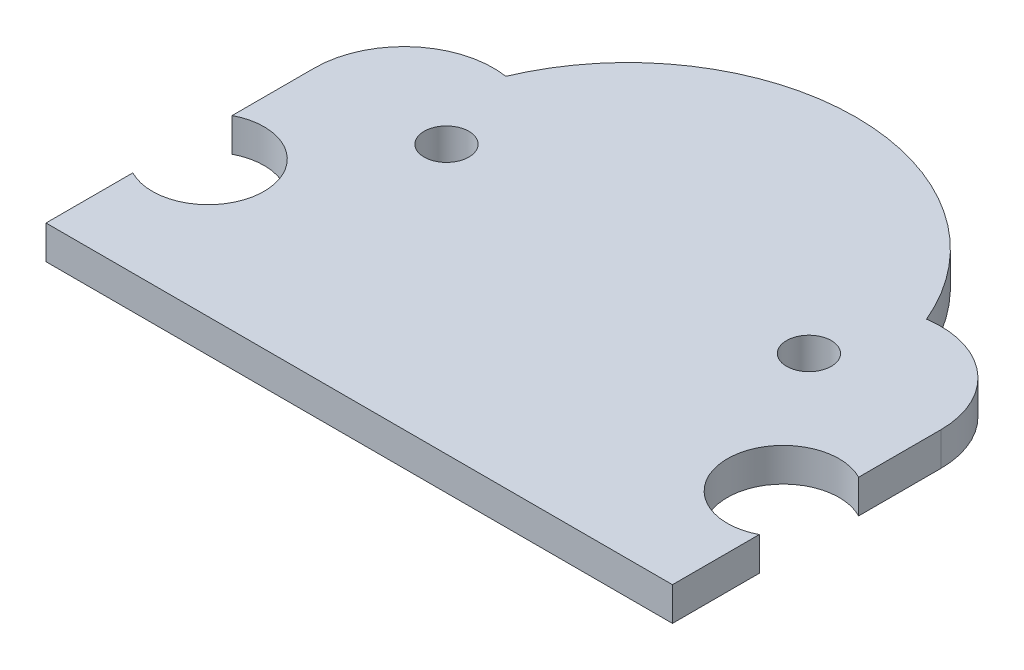
ISO-10303-21;
HEADER;
FILE_DESCRIPTION(('STEP AP214'),'2;1');
FILE_NAME('part.step','',(''),(''),'','','');
FILE_SCHEMA(('AUTOMOTIVE_DESIGN { 1 0 10303 214 1 1 1 1 }'));
ENDSEC;
DATA;
#1=APPLICATION_CONTEXT('core data for automotive mechanical design processes');
#2=APPLICATION_PROTOCOL_DEFINITION('international standard','automotive_design',2000,#1);
#3=PRODUCT_CONTEXT('',#1,'mechanical');
#4=PRODUCT('Part','Part','',(#3));
#5=PRODUCT_RELATED_PRODUCT_CATEGORY('part','',(#4));
#6=PRODUCT_DEFINITION_FORMATION('','',#4);
#7=PRODUCT_DEFINITION_CONTEXT('part definition',#1,'design');
#8=PRODUCT_DEFINITION('design','',#6,#7);
#9=PRODUCT_DEFINITION_SHAPE('','',#8);
#10=(LENGTH_UNIT() NAMED_UNIT(*) SI_UNIT(.MILLI.,.METRE.));
#11=(NAMED_UNIT(*) PLANE_ANGLE_UNIT() SI_UNIT($,.RADIAN.));
#12=(NAMED_UNIT(*) SI_UNIT($,.STERADIAN.) SOLID_ANGLE_UNIT());
#13=UNCERTAINTY_MEASURE_WITH_UNIT(LENGTH_MEASURE(1.E-05),#10,'distance_accuracy_value','');
#14=(GEOMETRIC_REPRESENTATION_CONTEXT(3) GLOBAL_UNCERTAINTY_ASSIGNED_CONTEXT((#13)) GLOBAL_UNIT_ASSIGNED_CONTEXT((#10,
#11,#12)) REPRESENTATION_CONTEXT('',''));
#15=CARTESIAN_POINT('',(0.,0.,0.));
#16=DIRECTION('',(0.,0.,1.));
#17=DIRECTION('',(1.,0.,0.));
#18=AXIS2_PLACEMENT_3D('',#15,#16,#17);
#19=CARTESIAN_POINT('',(26.85,1.5,-6.1));
#20=DIRECTION('',(0.,1.,0.));
#21=DIRECTION('',(0.,0.,1.));
#22=AXIS2_PLACEMENT_3D('',#19,#20,#21);
#23=PLANE('',#22);
#24=CARTESIAN_POINT('',(5.9,1.5,-12.));
#25=DIRECTION('',(0.,1.,0.));
#26=DIRECTION('',(0.,0.,1.));
#27=AXIS2_PLACEMENT_3D('',#24,#25,#26);
#28=CIRCLE('',#27,1.);
#29=CARTESIAN_POINT('',(5.9,1.5,-11.));
#30=VERTEX_POINT('',#29);
#31=EDGE_CURVE('E150',#30,#30,#28,.T.);
#32=ORIENTED_EDGE('',*,*,#31,.F.);
#33=EDGE_LOOP('',(#32));
#34=FACE_BOUND('',#33,.T.);
#35=DIRECTION('',(0.,0.,-1.));
#36=VECTOR('',#35,1.);
#37=CARTESIAN_POINT('',(28.,1.5,0.));
#38=LINE('',#37,#36);
#39=CARTESIAN_POINT('',(28.,1.5,0.));
#40=VERTEX_POINT('',#39);
#41=CARTESIAN_POINT('',(28.,1.5,-3.88020271195769));
#42=VERTEX_POINT('',#41);
#43=EDGE_CURVE('E165',#40,#42,#38,.T.);
#44=ORIENTED_EDGE('',*,*,#43,.T.);
#45=CARTESIAN_POINT('',(26.85,1.5,-6.1));
#46=DIRECTION('',(0.,-1.,0.));
#47=DIRECTION('',(0.,0.,1.));
#48=AXIS2_PLACEMENT_3D('',#45,#46,#47);
#49=CIRCLE('',#48,2.49999999999999);
#50=CARTESIAN_POINT('',(28.,1.5,-8.31979728804231));
#51=VERTEX_POINT('',#50);
#52=EDGE_CURVE('E103',#42,#51,#49,.T.);
#53=ORIENTED_EDGE('',*,*,#52,.T.);
#54=DIRECTION('',(0.,0.,-1.));
#55=VECTOR('',#54,1.);
#56=CARTESIAN_POINT('',(28.,1.5,-8.31979728804231));
#57=LINE('',#56,#55);
#58=CARTESIAN_POINT('',(28.,1.5,-12.));
#59=VERTEX_POINT('',#58);
#60=EDGE_CURVE('E186',#51,#59,#57,.T.);
#61=ORIENTED_EDGE('',*,*,#60,.T.);
#62=CARTESIAN_POINT('',(24.,1.5,-12.));
#63=DIRECTION('',(0.,1.,0.));
#64=DIRECTION('',(0.,0.,1.));
#65=AXIS2_PLACEMENT_3D('',#62,#63,#64);
#66=CIRCLE('',#65,4.00000000000001);
#67=CARTESIAN_POINT('',(23.4,1.5,-15.954743986657));
#68=VERTEX_POINT('',#67);
#69=EDGE_CURVE('E205',#59,#68,#66,.T.);
#70=ORIENTED_EDGE('',*,*,#69,.T.);
#71=CARTESIAN_POINT('',(14.,1.5,-12.));
#72=DIRECTION('',(0.,1.,0.));
#73=DIRECTION('',(0.,0.,1.));
#74=AXIS2_PLACEMENT_3D('',#71,#72,#73);
#75=CIRCLE('',#74,10.1980390271856);
#76=CARTESIAN_POINT('',(4.59999999999999,1.5,-15.954743986657));
#77=VERTEX_POINT('',#76);
#78=EDGE_CURVE('E202',#68,#77,#75,.T.);
#79=ORIENTED_EDGE('',*,*,#78,.T.);
#80=CARTESIAN_POINT('',(4.,1.5,-12.));
#81=DIRECTION('',(0.,1.,0.));
#82=DIRECTION('',(0.,0.,1.));
#83=AXIS2_PLACEMENT_3D('',#80,#81,#82);
#84=CIRCLE('',#83,4.);
#85=CARTESIAN_POINT('',(0.,1.5,-12.));
#86=VERTEX_POINT('',#85);
#87=EDGE_CURVE('E204',#77,#86,#84,.T.);
#88=ORIENTED_EDGE('',*,*,#87,.T.);
#89=DIRECTION('',(0.,0.,1.));
#90=VECTOR('',#89,1.);
#91=CARTESIAN_POINT('',(0.,1.5,-12.));
#92=LINE('',#91,#90);
#93=CARTESIAN_POINT('',(0.,1.5,-8.31979728804232));
#94=VERTEX_POINT('',#93);
#95=EDGE_CURVE('E128',#86,#94,#92,.T.);
#96=ORIENTED_EDGE('',*,*,#95,.T.);
#97=CARTESIAN_POINT('',(1.15,1.5,-6.1));
#98=DIRECTION('',(0.,-1.,0.));
#99=DIRECTION('',(0.,0.,1.));
#100=AXIS2_PLACEMENT_3D('',#97,#98,#99);
#101=CIRCLE('',#100,2.5);
#102=CARTESIAN_POINT('',(0.,1.5,-3.88020271195769));
#103=VERTEX_POINT('',#102);
#104=EDGE_CURVE('E122',#94,#103,#101,.T.);
#105=ORIENTED_EDGE('',*,*,#104,.T.);
#106=DIRECTION('',(0.,0.,1.));
#107=VECTOR('',#106,1.);
#108=CARTESIAN_POINT('',(0.,1.5,-3.88020271195769));
#109=LINE('',#108,#107);
#110=CARTESIAN_POINT('',(0.,1.5,0.));
#111=VERTEX_POINT('',#110);
#112=EDGE_CURVE('E126',#103,#111,#109,.T.);
#113=ORIENTED_EDGE('',*,*,#112,.T.);
#114=DIRECTION('',(1.,0.,0.));
#115=VECTOR('',#114,1.);
#116=CARTESIAN_POINT('',(0.,1.5,0.));
#117=LINE('',#116,#115);
#118=EDGE_CURVE('E54',#111,#40,#117,.T.);
#119=ORIENTED_EDGE('',*,*,#118,.T.);
#120=EDGE_LOOP('',(#44,#53,#61,#70,#79,#88,#96,#105,#113,#119));
#121=FACE_BOUND('',#120,.T.);
#122=CARTESIAN_POINT('',(22.1,1.5,-12.));
#123=DIRECTION('',(0.,1.,0.));
#124=DIRECTION('',(0.,0.,1.));
#125=AXIS2_PLACEMENT_3D('',#122,#123,#124);
#126=CIRCLE('',#125,1.);
#127=CARTESIAN_POINT('',(22.1,1.5,-11.));
#128=VERTEX_POINT('',#127);
#129=EDGE_CURVE('E216',#128,#128,#126,.T.);
#130=ORIENTED_EDGE('',*,*,#129,.F.);
#131=EDGE_LOOP('',(#130));
#132=FACE_BOUND('',#131,.T.);
#133=ADVANCED_FACE('F37',(#34,#121,#132),#23,.T.);
#134=CARTESIAN_POINT('',(26.85,0.,-6.1));
#135=DIRECTION('',(0.,1.,0.));
#136=DIRECTION('',(0.,0.,1.));
#137=AXIS2_PLACEMENT_3D('',#134,#135,#136);
#138=PLANE('',#137);
#139=DIRECTION('',(0.,0.,-1.));
#140=VECTOR('',#139,1.);
#141=CARTESIAN_POINT('',(28.,0.,0.));
#142=LINE('',#141,#140);
#143=CARTESIAN_POINT('',(28.,0.,0.));
#144=VERTEX_POINT('',#143);
#145=CARTESIAN_POINT('',(28.,0.,-3.88020271195769));
#146=VERTEX_POINT('',#145);
#147=EDGE_CURVE('E146',#144,#146,#142,.T.);
#148=ORIENTED_EDGE('',*,*,#147,.F.);
#149=DIRECTION('',(1.,0.,0.));
#150=VECTOR('',#149,1.);
#151=CARTESIAN_POINT('',(0.,0.,0.));
#152=LINE('',#151,#150);
#153=CARTESIAN_POINT('',(0.,0.,0.));
#154=VERTEX_POINT('',#153);
#155=EDGE_CURVE('E95',#154,#144,#152,.T.);
#156=ORIENTED_EDGE('',*,*,#155,.F.);
#157=DIRECTION('',(0.,0.,1.));
#158=VECTOR('',#157,1.);
#159=CARTESIAN_POINT('',(0.,0.,-3.88020271195769));
#160=LINE('',#159,#158);
#161=CARTESIAN_POINT('',(0.,0.,-3.88020271195769));
#162=VERTEX_POINT('',#161);
#163=EDGE_CURVE('E89',#162,#154,#160,.T.);
#164=ORIENTED_EDGE('',*,*,#163,.F.);
#165=CARTESIAN_POINT('',(1.15,0.,-6.1));
#166=DIRECTION('',(0.,-1.,0.));
#167=DIRECTION('',(0.,0.,1.));
#168=AXIS2_PLACEMENT_3D('',#165,#166,#167);
#169=CIRCLE('',#168,2.5);
#170=CARTESIAN_POINT('',(0.,0.,-8.31979728804232));
#171=VERTEX_POINT('',#170);
#172=EDGE_CURVE('E136',#171,#162,#169,.T.);
#173=ORIENTED_EDGE('',*,*,#172,.F.);
#174=DIRECTION('',(0.,0.,1.));
#175=VECTOR('',#174,1.);
#176=CARTESIAN_POINT('',(0.,0.,-12.));
#177=LINE('',#176,#175);
#178=CARTESIAN_POINT('',(0.,0.,-12.));
#179=VERTEX_POINT('',#178);
#180=EDGE_CURVE('E160',#179,#171,#177,.T.);
#181=ORIENTED_EDGE('',*,*,#180,.F.);
#182=CARTESIAN_POINT('',(4.,0.,-12.));
#183=DIRECTION('',(0.,1.,0.));
#184=DIRECTION('',(0.,0.,1.));
#185=AXIS2_PLACEMENT_3D('',#182,#183,#184);
#186=CIRCLE('',#185,4.);
#187=CARTESIAN_POINT('',(4.59999999999999,0.,-15.954743986657));
#188=VERTEX_POINT('',#187);
#189=EDGE_CURVE('E158',#188,#179,#186,.T.);
#190=ORIENTED_EDGE('',*,*,#189,.F.);
#191=CARTESIAN_POINT('',(14.,0.,-12.));
#192=DIRECTION('',(0.,1.,0.));
#193=DIRECTION('',(0.,0.,1.));
#194=AXIS2_PLACEMENT_3D('',#191,#192,#193);
#195=CIRCLE('',#194,10.1980390271856);
#196=CARTESIAN_POINT('',(23.4,0.,-15.954743986657));
#197=VERTEX_POINT('',#196);
#198=EDGE_CURVE('E156',#197,#188,#195,.T.);
#199=ORIENTED_EDGE('',*,*,#198,.F.);
#200=CARTESIAN_POINT('',(24.,0.,-12.));
#201=DIRECTION('',(0.,1.,0.));
#202=DIRECTION('',(0.,0.,1.));
#203=AXIS2_PLACEMENT_3D('',#200,#201,#202);
#204=CIRCLE('',#203,4.00000000000001);
#205=CARTESIAN_POINT('',(28.,0.,-12.));
#206=VERTEX_POINT('',#205);
#207=EDGE_CURVE('E154',#206,#197,#204,.T.);
#208=ORIENTED_EDGE('',*,*,#207,.F.);
#209=DIRECTION('',(0.,0.,-1.));
#210=VECTOR('',#209,1.);
#211=CARTESIAN_POINT('',(28.,0.,-8.31979728804231));
#212=LINE('',#211,#210);
#213=CARTESIAN_POINT('',(28.,0.,-8.31979728804231));
#214=VERTEX_POINT('',#213);
#215=EDGE_CURVE('E152',#214,#206,#212,.T.);
#216=ORIENTED_EDGE('',*,*,#215,.F.);
#217=CARTESIAN_POINT('',(26.85,0.,-6.1));
#218=DIRECTION('',(0.,-1.,0.));
#219=DIRECTION('',(0.,0.,1.));
#220=AXIS2_PLACEMENT_3D('',#217,#218,#219);
#221=CIRCLE('',#220,2.49999999999999);
#222=EDGE_CURVE('E149',#146,#214,#221,.T.);
#223=ORIENTED_EDGE('',*,*,#222,.F.);
#224=EDGE_LOOP('',(#148,#156,#164,#173,#181,#190,#199,#208,#216,#223));
#225=FACE_BOUND('',#224,.T.);
#226=CARTESIAN_POINT('',(5.9,0.,-12.));
#227=DIRECTION('',(0.,1.,0.));
#228=DIRECTION('',(0.,0.,1.));
#229=AXIS2_PLACEMENT_3D('',#226,#227,#228);
#230=CIRCLE('',#229,1.);
#231=CARTESIAN_POINT('',(5.9,0.,-11.));
#232=VERTEX_POINT('',#231);
#233=EDGE_CURVE('E213',#232,#232,#230,.T.);
#234=ORIENTED_EDGE('',*,*,#233,.T.);
#235=EDGE_LOOP('',(#234));
#236=FACE_BOUND('',#235,.T.);
#237=CARTESIAN_POINT('',(22.1,0.,-12.));
#238=DIRECTION('',(0.,1.,0.));
#239=DIRECTION('',(0.,0.,1.));
#240=AXIS2_PLACEMENT_3D('',#237,#238,#239);
#241=CIRCLE('',#240,1.);
#242=CARTESIAN_POINT('',(22.1,0.,-11.));
#243=VERTEX_POINT('',#242);
#244=EDGE_CURVE('E219',#243,#243,#241,.T.);
#245=ORIENTED_EDGE('',*,*,#244,.T.);
#246=EDGE_LOOP('',(#245));
#247=FACE_BOUND('',#246,.T.);
#248=ADVANCED_FACE('F190',(#225,#236,#247),#138,.F.);
#249=CARTESIAN_POINT('',(28.,1.5,0.));
#250=DIRECTION('',(-1.,0.,0.));
#251=DIRECTION('',(0.,0.,1.));
#252=AXIS2_PLACEMENT_3D('',#249,#250,#251);
#253=PLANE('',#252);
#254=ORIENTED_EDGE('',*,*,#147,.T.);
#255=DIRECTION('',(0.,-1.,0.));
#256=VECTOR('',#255,1.);
#257=CARTESIAN_POINT('',(28.,1.5,-3.88020271195769));
#258=LINE('',#257,#256);
#259=EDGE_CURVE('E11',#42,#146,#258,.T.);
#260=ORIENTED_EDGE('',*,*,#259,.F.);
#261=ORIENTED_EDGE('',*,*,#43,.F.);
#262=DIRECTION('',(0.,-1.,0.));
#263=VECTOR('',#262,1.);
#264=CARTESIAN_POINT('',(28.,1.5,0.));
#265=LINE('',#264,#263);
#266=EDGE_CURVE('E142',#40,#144,#265,.T.);
#267=ORIENTED_EDGE('',*,*,#266,.T.);
#268=EDGE_LOOP('',(#254,#260,#261,#267));
#269=FACE_BOUND('',#268,.T.);
#270=ADVANCED_FACE('F39',(#269),#253,.F.);
#271=CARTESIAN_POINT('',(26.85,1.5,-6.1));
#272=DIRECTION('',(0.,-1.,0.));
#273=DIRECTION('',(0.,0.,-1.));
#274=AXIS2_PLACEMENT_3D('',#271,#272,#273);
#275=CYLINDRICAL_SURFACE('',#274,2.49999999999999);
#276=ORIENTED_EDGE('',*,*,#222,.T.);
#277=DIRECTION('',(0.,-1.,0.));
#278=VECTOR('',#277,1.);
#279=CARTESIAN_POINT('',(28.,1.5,-8.31979728804231));
#280=LINE('',#279,#278);
#281=EDGE_CURVE('E46',#51,#214,#280,.T.);
#282=ORIENTED_EDGE('',*,*,#281,.F.);
#283=ORIENTED_EDGE('',*,*,#52,.F.);
#284=ORIENTED_EDGE('',*,*,#259,.T.);
#285=EDGE_LOOP('',(#276,#282,#283,#284));
#286=FACE_BOUND('',#285,.T.);
#287=ADVANCED_FACE('F259',(#286),#275,.F.);
#288=CARTESIAN_POINT('',(28.,1.5,-8.31979728804231));
#289=DIRECTION('',(-1.,0.,0.));
#290=DIRECTION('',(0.,0.,1.));
#291=AXIS2_PLACEMENT_3D('',#288,#289,#290);
#292=PLANE('',#291);
#293=ORIENTED_EDGE('',*,*,#215,.T.);
#294=DIRECTION('',(0.,-1.,0.));
#295=VECTOR('',#294,1.);
#296=CARTESIAN_POINT('',(28.,1.5,-12.));
#297=LINE('',#296,#295);
#298=EDGE_CURVE('E178',#59,#206,#297,.T.);
#299=ORIENTED_EDGE('',*,*,#298,.F.);
#300=ORIENTED_EDGE('',*,*,#60,.F.);
#301=ORIENTED_EDGE('',*,*,#281,.T.);
#302=EDGE_LOOP('',(#293,#299,#300,#301));
#303=FACE_BOUND('',#302,.T.);
#304=ADVANCED_FACE('F184',(#303),#292,.F.);
#305=CARTESIAN_POINT('',(24.,1.5,-12.));
#306=DIRECTION('',(0.,-1.,0.));
#307=DIRECTION('',(0.,0.,-1.));
#308=AXIS2_PLACEMENT_3D('',#305,#306,#307);
#309=CYLINDRICAL_SURFACE('',#308,4.00000000000001);
#310=ORIENTED_EDGE('',*,*,#207,.T.);
#311=DIRECTION('',(0.,-1.,0.));
#312=VECTOR('',#311,1.);
#313=CARTESIAN_POINT('',(23.4,1.5,-15.954743986657));
#314=LINE('',#313,#312);
#315=EDGE_CURVE('E175',#68,#197,#314,.T.);
#316=ORIENTED_EDGE('',*,*,#315,.F.);
#317=ORIENTED_EDGE('',*,*,#69,.F.);
#318=ORIENTED_EDGE('',*,*,#298,.T.);
#319=EDGE_LOOP('',(#310,#316,#317,#318));
#320=FACE_BOUND('',#319,.T.);
#321=ADVANCED_FACE('F196',(#320),#309,.T.);
#322=CARTESIAN_POINT('',(14.,1.5,-12.));
#323=DIRECTION('',(0.,-1.,0.));
#324=DIRECTION('',(0.,0.,-1.));
#325=AXIS2_PLACEMENT_3D('',#322,#323,#324);
#326=CYLINDRICAL_SURFACE('',#325,10.1980390271856);
#327=ORIENTED_EDGE('',*,*,#198,.T.);
#328=DIRECTION('',(0.,-1.,0.));
#329=VECTOR('',#328,1.);
#330=CARTESIAN_POINT('',(4.59999999999999,1.5,-15.954743986657));
#331=LINE('',#330,#329);
#332=EDGE_CURVE('E172',#77,#188,#331,.T.);
#333=ORIENTED_EDGE('',*,*,#332,.F.);
#334=ORIENTED_EDGE('',*,*,#78,.F.);
#335=ORIENTED_EDGE('',*,*,#315,.T.);
#336=EDGE_LOOP('',(#327,#333,#334,#335));
#337=FACE_BOUND('',#336,.T.);
#338=ADVANCED_FACE('F200',(#337),#326,.T.);
#339=CARTESIAN_POINT('',(4.,1.5,-12.));
#340=DIRECTION('',(0.,-1.,0.));
#341=DIRECTION('',(0.,0.,-1.));
#342=AXIS2_PLACEMENT_3D('',#339,#340,#341);
#343=CYLINDRICAL_SURFACE('',#342,4.);
#344=ORIENTED_EDGE('',*,*,#189,.T.);
#345=DIRECTION('',(0.,-1.,0.));
#346=VECTOR('',#345,1.);
#347=CARTESIAN_POINT('',(0.,1.5,-12.));
#348=LINE('',#347,#346);
#349=EDGE_CURVE('E169',#86,#179,#348,.T.);
#350=ORIENTED_EDGE('',*,*,#349,.F.);
#351=ORIENTED_EDGE('',*,*,#87,.F.);
#352=ORIENTED_EDGE('',*,*,#332,.T.);
#353=EDGE_LOOP('',(#344,#350,#351,#352));
#354=FACE_BOUND('',#353,.T.);
#355=ADVANCED_FACE('F249',(#354),#343,.T.);
#356=CARTESIAN_POINT('',(0.,1.5,-12.));
#357=DIRECTION('',(1.,0.,0.));
#358=DIRECTION('',(0.,0.,-1.));
#359=AXIS2_PLACEMENT_3D('',#356,#357,#358);
#360=PLANE('',#359);
#361=ORIENTED_EDGE('',*,*,#180,.T.);
#362=DIRECTION('',(0.,-1.,0.));
#363=VECTOR('',#362,1.);
#364=CARTESIAN_POINT('',(0.,1.5,-8.31979728804232));
#365=LINE('',#364,#363);
#366=EDGE_CURVE('E137',#94,#171,#365,.T.);
#367=ORIENTED_EDGE('',*,*,#366,.F.);
#368=ORIENTED_EDGE('',*,*,#95,.F.);
#369=ORIENTED_EDGE('',*,*,#349,.T.);
#370=EDGE_LOOP('',(#361,#367,#368,#369));
#371=FACE_BOUND('',#370,.T.);
#372=ADVANCED_FACE('F246',(#371),#360,.F.);
#373=CARTESIAN_POINT('',(1.15,1.5,-6.1));
#374=DIRECTION('',(0.,-1.,0.));
#375=DIRECTION('',(0.,0.,-1.));
#376=AXIS2_PLACEMENT_3D('',#373,#374,#375);
#377=CYLINDRICAL_SURFACE('',#376,2.5);
#378=ORIENTED_EDGE('',*,*,#172,.T.);
#379=DIRECTION('',(0.,-1.,0.));
#380=VECTOR('',#379,1.);
#381=CARTESIAN_POINT('',(0.,1.5,-3.88020271195769));
#382=LINE('',#381,#380);
#383=EDGE_CURVE('E133',#103,#162,#382,.T.);
#384=ORIENTED_EDGE('',*,*,#383,.F.);
#385=ORIENTED_EDGE('',*,*,#104,.F.);
#386=ORIENTED_EDGE('',*,*,#366,.T.);
#387=EDGE_LOOP('',(#378,#384,#385,#386));
#388=FACE_BOUND('',#387,.T.);
#389=ADVANCED_FACE('F134',(#388),#377,.F.);
#390=CARTESIAN_POINT('',(0.,1.5,-3.88020271195769));
#391=DIRECTION('',(1.,0.,0.));
#392=DIRECTION('',(0.,0.,-1.));
#393=AXIS2_PLACEMENT_3D('',#390,#391,#392);
#394=PLANE('',#393);
#395=ORIENTED_EDGE('',*,*,#163,.T.);
#396=DIRECTION('',(0.,-1.,0.));
#397=VECTOR('',#396,1.);
#398=CARTESIAN_POINT('',(0.,1.5,0.));
#399=LINE('',#398,#397);
#400=EDGE_CURVE('E138',#111,#154,#399,.T.);
#401=ORIENTED_EDGE('',*,*,#400,.F.);
#402=ORIENTED_EDGE('',*,*,#112,.F.);
#403=ORIENTED_EDGE('',*,*,#383,.T.);
#404=EDGE_LOOP('',(#395,#401,#402,#403));
#405=FACE_BOUND('',#404,.T.);
#406=ADVANCED_FACE('F140',(#405),#394,.F.);
#407=CARTESIAN_POINT('',(0.,1.5,0.));
#408=DIRECTION('',(0.,0.,-1.));
#409=DIRECTION('',(-1.,0.,0.));
#410=AXIS2_PLACEMENT_3D('',#407,#408,#409);
#411=PLANE('',#410);
#412=ORIENTED_EDGE('',*,*,#155,.T.);
#413=ORIENTED_EDGE('',*,*,#266,.F.);
#414=ORIENTED_EDGE('',*,*,#118,.F.);
#415=ORIENTED_EDGE('',*,*,#400,.T.);
#416=EDGE_LOOP('',(#412,#413,#414,#415));
#417=FACE_BOUND('',#416,.T.);
#418=ADVANCED_FACE('F239',(#417),#411,.F.);
#419=CARTESIAN_POINT('',(5.9,1.5,-12.));
#420=DIRECTION('',(0.,-1.,0.));
#421=DIRECTION('',(0.,0.,-1.));
#422=AXIS2_PLACEMENT_3D('',#419,#420,#421);
#423=CYLINDRICAL_SURFACE('',#422,1.);
#424=ORIENTED_EDGE('',*,*,#31,.T.);
#425=EDGE_LOOP('',(#424));
#426=FACE_BOUND('',#425,.T.);
#427=ORIENTED_EDGE('',*,*,#233,.F.);
#428=EDGE_LOOP('',(#427));
#429=FACE_BOUND('',#428,.T.);
#430=ADVANCED_FACE('F236',(#426,#429),#423,.F.);
#431=CARTESIAN_POINT('',(22.1,1.5,-12.));
#432=DIRECTION('',(0.,-1.,0.));
#433=DIRECTION('',(0.,0.,-1.));
#434=AXIS2_PLACEMENT_3D('',#431,#432,#433);
#435=CYLINDRICAL_SURFACE('',#434,1.);
#436=ORIENTED_EDGE('',*,*,#129,.T.);
#437=EDGE_LOOP('',(#436));
#438=FACE_BOUND('',#437,.T.);
#439=ORIENTED_EDGE('',*,*,#244,.F.);
#440=EDGE_LOOP('',(#439));
#441=FACE_BOUND('',#440,.T.);
#442=ADVANCED_FACE('F225',(#438,#441),#435,.F.);
#443=CLOSED_SHELL('',(#133,#248,#270,#287,#304,#321,#338,#355,#372,#389,#406,#418,#430,#442));
#444=MANIFOLD_SOLID_BREP('B2',#443);
#445=ADVANCED_BREP_SHAPE_REPRESENTATION('',(#18,#444),#14);
#446=SHAPE_DEFINITION_REPRESENTATION(#9,#445);
ENDSEC;
END-ISO-10303-21;
